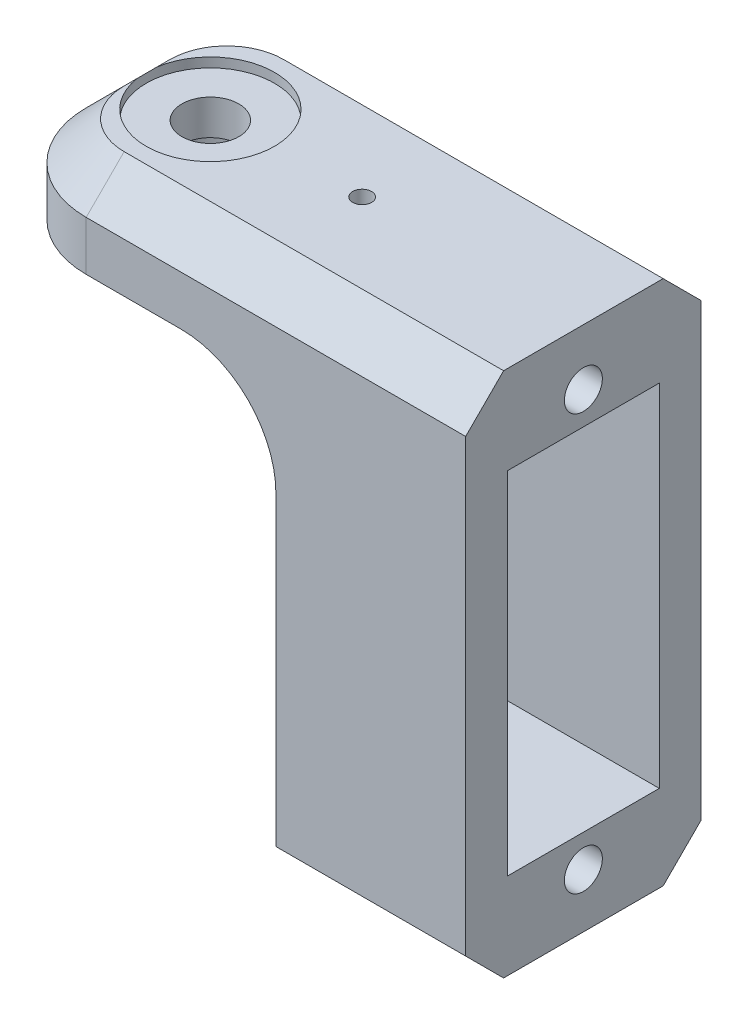
ISO-10303-21;
HEADER;
FILE_DESCRIPTION(('STEP AP214'),'2;1');
FILE_NAME('part.step','',(''),(''),'','','');
FILE_SCHEMA(('AUTOMOTIVE_DESIGN { 1 0 10303 214 1 1 1 1 }'));
ENDSEC;
DATA;
#1=APPLICATION_CONTEXT('core data for automotive mechanical design processes');
#2=APPLICATION_PROTOCOL_DEFINITION('international standard','automotive_design',2000,#1);
#3=PRODUCT_CONTEXT('',#1,'mechanical');
#4=PRODUCT('Part','Part','',(#3));
#5=PRODUCT_RELATED_PRODUCT_CATEGORY('part','',(#4));
#6=PRODUCT_DEFINITION_FORMATION('','',#4);
#7=PRODUCT_DEFINITION_CONTEXT('part definition',#1,'design');
#8=PRODUCT_DEFINITION('design','',#6,#7);
#9=PRODUCT_DEFINITION_SHAPE('','',#8);
#10=(LENGTH_UNIT() NAMED_UNIT(*) SI_UNIT(.MILLI.,.METRE.));
#11=(NAMED_UNIT(*) PLANE_ANGLE_UNIT() SI_UNIT($,.RADIAN.));
#12=(NAMED_UNIT(*) SI_UNIT($,.STERADIAN.) SOLID_ANGLE_UNIT());
#13=UNCERTAINTY_MEASURE_WITH_UNIT(LENGTH_MEASURE(1.E-05),#10,'distance_accuracy_value','');
#14=(GEOMETRIC_REPRESENTATION_CONTEXT(3) GLOBAL_UNCERTAINTY_ASSIGNED_CONTEXT((#13)) GLOBAL_UNIT_ASSIGNED_CONTEXT((#10,
#11,#12)) REPRESENTATION_CONTEXT('',''));
#15=CARTESIAN_POINT('',(0.,0.,0.));
#16=DIRECTION('',(0.,0.,1.));
#17=DIRECTION('',(1.,0.,0.));
#18=AXIS2_PLACEMENT_3D('',#15,#16,#17);
#19=CARTESIAN_POINT('',(0.,0.,0.));
#20=DIRECTION('',(1.,0.,0.));
#21=DIRECTION('',(0.,0.,-1.));
#22=AXIS2_PLACEMENT_3D('',#19,#20,#21);
#23=PLANE('',#22);
#24=DIRECTION('',(0.,-1.,0.));
#25=VECTOR('',#24,1.);
#26=CARTESIAN_POINT('',(0.,20.4056830834917,-3.30344253941829));
#27=LINE('',#26,#25);
#28=CARTESIAN_POINT('',(0.,20.4056830834917,-3.30344253941829));
#29=VERTEX_POINT('',#28);
#30=CARTESIAN_POINT('',(0.,19.0932279719726,-3.30344253941829));
#31=VERTEX_POINT('',#30);
#32=EDGE_CURVE('E232',#29,#31,#27,.T.);
#33=ORIENTED_EDGE('',*,*,#32,.T.);
#34=DIRECTION('',(0.,0.,1.));
#35=VECTOR('',#34,1.);
#36=CARTESIAN_POINT('',(0.,19.0932279719726,-5.23352020477033));
#37=LINE('',#36,#35);
#38=CARTESIAN_POINT('',(0.,19.0932279719726,0.696557460581707));
#39=VERTEX_POINT('',#38);
#40=EDGE_CURVE('E230',#31,#39,#37,.T.);
#41=ORIENTED_EDGE('',*,*,#40,.T.);
#42=DIRECTION('',(0.,-1.,0.));
#43=VECTOR('',#42,1.);
#44=CARTESIAN_POINT('',(0.,20.4056830834917,0.696557460581706));
#45=LINE('',#44,#43);
#46=CARTESIAN_POINT('',(0.,20.4056830834917,0.696557460581706));
#47=VERTEX_POINT('',#46);
#48=EDGE_CURVE('E228',#47,#39,#45,.T.);
#49=ORIENTED_EDGE('',*,*,#48,.F.);
#50=DIRECTION('',(0.,0.,1.));
#51=VECTOR('',#50,1.);
#52=CARTESIAN_POINT('',(0.,20.4056830834917,0.696557460581706));
#53=LINE('',#52,#51);
#54=CARTESIAN_POINT('',(0.,20.4056830834917,-0.313787357402423));
#55=VERTEX_POINT('',#54);
#56=EDGE_CURVE('E213',#55,#47,#53,.T.);
#57=ORIENTED_EDGE('',*,*,#56,.F.);
#58=CARTESIAN_POINT('',(0.,20.7982279719726,-1.23352020477033));
#59=DIRECTION('',(1.,0.,0.));
#60=DIRECTION('',(0.,0.,-1.));
#61=AXIS2_PLACEMENT_3D('',#58,#59,#60);
#62=CIRCLE('',#61,1.);
#63=CARTESIAN_POINT('',(0.,20.4056830834917,-2.15325305213825));
#64=VERTEX_POINT('',#63);
#65=EDGE_CURVE('E275',#55,#64,#62,.T.);
#66=ORIENTED_EDGE('',*,*,#65,.T.);
#67=EDGE_CURVE('E226',#29,#64,#53,.T.);
#68=ORIENTED_EDGE('',*,*,#67,.F.);
#69=EDGE_LOOP('',(#33,#41,#49,#57,#66,#68));
#70=FACE_BOUND('',#69,.T.);
#71=ADVANCED_FACE('F36',(#70),#23,.F.);
#72=CARTESIAN_POINT('',(-9.66004529388442,23.7590291408107,-1.23352020477033));
#73=DIRECTION('',(0.,-1.,0.));
#74=DIRECTION('',(0.,0.,-1.));
#75=AXIS2_PLACEMENT_3D('',#72,#73,#74);
#76=CYLINDRICAL_SURFACE('',#75,1.5);
#77=CARTESIAN_POINT('',(-9.66004529388442,21.4056830834917,-1.23352020477033));
#78=DIRECTION('',(0.,-1.,0.));
#79=DIRECTION('',(0.,0.,-1.));
#80=AXIS2_PLACEMENT_3D('',#77,#78,#79);
#81=CIRCLE('',#80,1.5);
#82=CARTESIAN_POINT('',(-9.66004529388442,21.4056830834917,-2.73352020477033));
#83=VERTEX_POINT('',#82);
#84=EDGE_CURVE('E245',#83,#83,#81,.T.);
#85=ORIENTED_EDGE('',*,*,#84,.T.);
#86=EDGE_LOOP('',(#85));
#87=FACE_BOUND('',#86,.T.);
#88=CARTESIAN_POINT('',(-9.66004529388442,23.2590291408107,-1.23352020477033));
#89=DIRECTION('',(0.,1.,0.));
#90=DIRECTION('',(0.,0.,1.));
#91=AXIS2_PLACEMENT_3D('',#88,#89,#90);
#92=CIRCLE('',#91,1.5);
#93=CARTESIAN_POINT('',(-9.66004529388442,23.2590291408107,0.266479795229666));
#94=VERTEX_POINT('',#93);
#95=EDGE_CURVE('E349',#94,#94,#92,.F.);
#96=ORIENTED_EDGE('',*,*,#95,.F.);
#97=EDGE_LOOP('',(#96));
#98=FACE_BOUND('',#97,.T.);
#99=ADVANCED_FACE('F491',(#87,#98),#76,.F.);
#100=CARTESIAN_POINT('',(0.,0.,0.));
#101=DIRECTION('',(-1.,0.,0.));
#102=DIRECTION('',(0.,0.,1.));
#103=AXIS2_PLACEMENT_3D('',#100,#101,#102);
#104=PLANE('',#103);
#105=EDGE_CURVE('E220',#64,#55,#53,.T.);
#106=ORIENTED_EDGE('',*,*,#105,.F.);
#107=EDGE_CURVE('E268',#64,#55,#62,.T.);
#108=ORIENTED_EDGE('',*,*,#107,.T.);
#109=EDGE_LOOP('',(#106,#108));
#110=FACE_BOUND('',#109,.T.);
#111=ADVANCED_FACE('F486',(#110),#104,.F.);
#112=CARTESIAN_POINT('',(0.,-1.11177202802737,-1.23352020477033));
#113=DIRECTION('',(1.,0.,0.));
#114=DIRECTION('',(0.,0.,-1.));
#115=AXIS2_PLACEMENT_3D('',#112,#113,#114);
#116=CIRCLE('',#115,1.);
#117=CARTESIAN_POINT('',(0.,-1.11177202802737,-2.23352020477033));
#118=VERTEX_POINT('',#117);
#119=EDGE_CURVE('E264',#118,#118,#116,.T.);
#120=ORIENTED_EDGE('',*,*,#119,.T.);
#121=EDGE_LOOP('',(#120));
#122=FACE_BOUND('',#121,.T.);
#123=DIRECTION('',(0.,1.,0.));
#124=VECTOR('',#123,1.);
#125=CARTESIAN_POINT('',(0.,19.0932279719726,-5.23352020477033));
#126=LINE('',#125,#124);
#127=CARTESIAN_POINT('',(0.,0.593227971972626,-5.23352020477033));
#128=VERTEX_POINT('',#127);
#129=CARTESIAN_POINT('',(0.,14.1556830834917,-5.23352020477033));
#130=VERTEX_POINT('',#129);
#131=EDGE_CURVE('E290',#128,#130,#126,.T.);
#132=ORIENTED_EDGE('',*,*,#131,.T.);
#133=DIRECTION('',(0.,0.,1.));
#134=VECTOR('',#133,1.);
#135=CARTESIAN_POINT('',(0.,14.1556830834917,-7.43813416602722));
#136=LINE('',#135,#134);
#137=CARTESIAN_POINT('',(0.,14.1556830834917,-7.43813416602722));
#138=VERTEX_POINT('',#137);
#139=EDGE_CURVE('E420',#130,#138,#136,.F.);
#140=ORIENTED_EDGE('',*,*,#139,.T.);
#141=DIRECTION('',(0.,1.,0.));
#142=VECTOR('',#141,1.);
#143=CARTESIAN_POINT('',(0.,23.7590291408107,-7.43813416602722));
#144=LINE('',#143,#142);
#145=CARTESIAN_POINT('',(0.,-1.95953812104998,-7.43813416602722));
#146=VERTEX_POINT('',#145);
#147=EDGE_CURVE('E302',#146,#138,#144,.T.);
#148=ORIENTED_EDGE('',*,*,#147,.F.);
#149=DIRECTION('',(0.,0.707106781186547,-0.707106781186548));
#150=VECTOR('',#149,1.);
#151=CARTESIAN_POINT('',(0.,-1.95953812104999,-7.43813416602722));
#152=LINE('',#151,#150);
#153=CARTESIAN_POINT('',(0.,-3.95953812104999,-5.43813416602721));
#154=VERTEX_POINT('',#153);
#155=EDGE_CURVE('E393',#146,#154,#152,.F.);
#156=ORIENTED_EDGE('',*,*,#155,.T.);
#157=DIRECTION('',(0.,0.,-1.));
#158=VECTOR('',#157,1.);
#159=CARTESIAN_POINT('',(0.,-3.95953812104999,4.97109375648655));
#160=LINE('',#159,#158);
#161=CARTESIAN_POINT('',(0.,-3.95953812104999,2.97109375648655));
#162=VERTEX_POINT('',#161);
#163=EDGE_CURVE('E307',#162,#154,#160,.T.);
#164=ORIENTED_EDGE('',*,*,#163,.F.);
#165=DIRECTION('',(0.,-0.707106781186548,-0.707106781186547));
#166=VECTOR('',#165,1.);
#167=CARTESIAN_POINT('',(0.,-3.95953812104999,2.97109375648655));
#168=LINE('',#167,#166);
#169=CARTESIAN_POINT('',(0.,-1.95953812104998,4.97109375648655));
#170=VERTEX_POINT('',#169);
#171=EDGE_CURVE('E390',#162,#170,#168,.F.);
#172=ORIENTED_EDGE('',*,*,#171,.T.);
#173=DIRECTION('',(0.,-1.,0.));
#174=VECTOR('',#173,1.);
#175=CARTESIAN_POINT('',(0.,23.7590291408107,4.97109375648655));
#176=LINE('',#175,#174);
#177=CARTESIAN_POINT('',(0.,14.1556830834917,4.97109375648655));
#178=VERTEX_POINT('',#177);
#179=EDGE_CURVE('E319',#178,#170,#176,.T.);
#180=ORIENTED_EDGE('',*,*,#179,.F.);
#181=DIRECTION('',(0.,0.,1.));
#182=VECTOR('',#181,1.);
#183=CARTESIAN_POINT('',(0.,14.1556830834917,0.696557460581707));
#184=LINE('',#183,#182);
#185=CARTESIAN_POINT('',(0.,14.1556830834917,2.76647979522967));
#186=VERTEX_POINT('',#185);
#187=EDGE_CURVE('E418',#178,#186,#184,.F.);
#188=ORIENTED_EDGE('',*,*,#187,.T.);
#189=DIRECTION('',(0.,-1.,0.));
#190=VECTOR('',#189,1.);
#191=CARTESIAN_POINT('',(0.,19.0932279719726,2.76647979522967));
#192=LINE('',#191,#190);
#193=CARTESIAN_POINT('',(0.,0.593227971972625,2.76647979522967));
#194=VERTEX_POINT('',#193);
#195=EDGE_CURVE('E274',#186,#194,#192,.T.);
#196=ORIENTED_EDGE('',*,*,#195,.T.);
#197=DIRECTION('',(0.,0.,-1.));
#198=VECTOR('',#197,1.);
#199=CARTESIAN_POINT('',(0.,0.593227971972626,-5.23352020477033));
#200=LINE('',#199,#198);
#201=EDGE_CURVE('E287',#194,#128,#200,.T.);
#202=ORIENTED_EDGE('',*,*,#201,.T.);
#203=EDGE_LOOP('',(#132,#140,#148,#156,#164,#172,#180,#188,#196,#202));
#204=FACE_BOUND('',#203,.T.);
#205=ADVANCED_FACE('F454',(#122,#204),#23,.F.);
#206=CARTESIAN_POINT('',(10.,0.,0.));
#207=DIRECTION('',(1.,0.,0.));
#208=DIRECTION('',(0.,0.,-1.));
#209=AXIS2_PLACEMENT_3D('',#206,#207,#208);
#210=PLANE('',#209);
#211=CARTESIAN_POINT('',(10.,20.7982279719726,-1.23352020477033));
#212=DIRECTION('',(1.,0.,0.));
#213=DIRECTION('',(0.,0.,-1.));
#214=AXIS2_PLACEMENT_3D('',#211,#212,#213);
#215=CIRCLE('',#214,1.);
#216=CARTESIAN_POINT('',(10.,20.7982279719726,-2.23352020477033));
#217=VERTEX_POINT('',#216);
#218=EDGE_CURVE('E271',#217,#217,#215,.T.);
#219=ORIENTED_EDGE('',*,*,#218,.F.);
#220=EDGE_LOOP('',(#219));
#221=FACE_BOUND('',#220,.T.);
#222=DIRECTION('',(0.,1.,0.));
#223=VECTOR('',#222,1.);
#224=CARTESIAN_POINT('',(10.,23.7590291408107,-7.43813416602722));
#225=LINE('',#224,#223);
#226=CARTESIAN_POINT('',(10.,-1.95953812104998,-7.43813416602722));
#227=VERTEX_POINT('',#226);
#228=CARTESIAN_POINT('',(10.,21.7590291408107,-7.43813416602722));
#229=VERTEX_POINT('',#228);
#230=EDGE_CURVE('E303',#227,#229,#225,.T.);
#231=ORIENTED_EDGE('',*,*,#230,.T.);
#232=DIRECTION('',(0.,-0.707106781186547,-0.707106781186548));
#233=VECTOR('',#232,1.);
#234=CARTESIAN_POINT('',(10.,14.598581653419,-14.598581653419));
#235=LINE('',#234,#233);
#236=CARTESIAN_POINT('',(10.,23.7590291408107,-5.43813416602721));
#237=VERTEX_POINT('',#236);
#238=EDGE_CURVE('E376',#229,#237,#235,.F.);
#239=ORIENTED_EDGE('',*,*,#238,.T.);
#240=DIRECTION('',(0.,0.,1.));
#241=VECTOR('',#240,1.);
#242=CARTESIAN_POINT('',(10.,23.7590291408107,4.97109375648655));
#243=LINE('',#242,#241);
#244=CARTESIAN_POINT('',(10.,23.7590291408107,2.97109375648654));
#245=VERTEX_POINT('',#244);
#246=EDGE_CURVE('E306',#237,#245,#243,.T.);
#247=ORIENTED_EDGE('',*,*,#246,.T.);
#248=DIRECTION('',(0.,0.707106781186547,-0.707106781186548));
#249=VECTOR('',#248,1.);
#250=CARTESIAN_POINT('',(10.,13.3650614486487,13.3650614486486));
#251=LINE('',#250,#249);
#252=CARTESIAN_POINT('',(10.,21.7590291408107,4.97109375648655));
#253=VERTEX_POINT('',#252);
#254=EDGE_CURVE('E374',#245,#253,#251,.F.);
#255=ORIENTED_EDGE('',*,*,#254,.T.);
#256=DIRECTION('',(0.,-1.,0.));
#257=VECTOR('',#256,1.);
#258=CARTESIAN_POINT('',(10.,23.7590291408107,4.97109375648655));
#259=LINE('',#258,#257);
#260=CARTESIAN_POINT('',(10.,-1.95953812104998,4.97109375648655));
#261=VERTEX_POINT('',#260);
#262=EDGE_CURVE('E310',#253,#261,#259,.T.);
#263=ORIENTED_EDGE('',*,*,#262,.T.);
#264=DIRECTION('',(0.,0.707106781186548,0.707106781186547));
#265=VECTOR('',#264,1.);
#266=CARTESIAN_POINT('',(10.,-3.46531593876826,3.46531593876827));
#267=LINE('',#266,#265);
#268=CARTESIAN_POINT('',(10.,-3.95953812104999,2.97109375648655));
#269=VERTEX_POINT('',#268);
#270=EDGE_CURVE('E370',#261,#269,#267,.F.);
#271=ORIENTED_EDGE('',*,*,#270,.T.);
#272=DIRECTION('',(0.,0.,-1.));
#273=VECTOR('',#272,1.);
#274=CARTESIAN_POINT('',(10.,-3.95953812104999,4.97109375648655));
#275=LINE('',#274,#273);
#276=CARTESIAN_POINT('',(10.,-3.95953812104999,-5.43813416602721));
#277=VERTEX_POINT('',#276);
#278=EDGE_CURVE('E313',#269,#277,#275,.T.);
#279=ORIENTED_EDGE('',*,*,#278,.T.);
#280=DIRECTION('',(0.,-0.707106781186547,0.707106781186548));
#281=VECTOR('',#280,1.);
#282=CARTESIAN_POINT('',(10.,-4.6988361435386,-4.6988361435386));
#283=LINE('',#282,#281);
#284=EDGE_CURVE('E372',#277,#227,#283,.F.);
#285=ORIENTED_EDGE('',*,*,#284,.T.);
#286=EDGE_LOOP('',(#231,#239,#247,#255,#263,#271,#279,#285));
#287=FACE_BOUND('',#286,.T.);
#288=DIRECTION('',(0.,0.,-1.));
#289=VECTOR('',#288,1.);
#290=CARTESIAN_POINT('',(10.,0.593227971972626,-5.23352020477033));
#291=LINE('',#290,#289);
#292=CARTESIAN_POINT('',(10.,0.593227971972625,2.76647979522967));
#293=VERTEX_POINT('',#292);
#294=CARTESIAN_POINT('',(10.,0.593227971972626,-5.23352020477033));
#295=VERTEX_POINT('',#294);
#296=EDGE_CURVE('E279',#293,#295,#291,.T.);
#297=ORIENTED_EDGE('',*,*,#296,.F.);
#298=DIRECTION('',(0.,-1.,0.));
#299=VECTOR('',#298,1.);
#300=CARTESIAN_POINT('',(10.,19.0932279719726,2.76647979522967));
#301=LINE('',#300,#299);
#302=CARTESIAN_POINT('',(10.,19.0932279719726,2.76647979522967));
#303=VERTEX_POINT('',#302);
#304=EDGE_CURVE('E277',#303,#293,#301,.T.);
#305=ORIENTED_EDGE('',*,*,#304,.F.);
#306=DIRECTION('',(0.,0.,1.));
#307=VECTOR('',#306,1.);
#308=CARTESIAN_POINT('',(10.,19.0932279719726,-5.23352020477033));
#309=LINE('',#308,#307);
#310=CARTESIAN_POINT('',(10.,19.0932279719726,-5.23352020477033));
#311=VERTEX_POINT('',#310);
#312=EDGE_CURVE('E284',#311,#303,#309,.T.);
#313=ORIENTED_EDGE('',*,*,#312,.F.);
#314=DIRECTION('',(0.,1.,0.));
#315=VECTOR('',#314,1.);
#316=CARTESIAN_POINT('',(10.,19.0932279719726,-5.23352020477033));
#317=LINE('',#316,#315);
#318=EDGE_CURVE('E281',#295,#311,#317,.T.);
#319=ORIENTED_EDGE('',*,*,#318,.F.);
#320=EDGE_LOOP('',(#297,#305,#313,#319));
#321=FACE_BOUND('',#320,.T.);
#322=CARTESIAN_POINT('',(10.,-1.11177202802737,-1.23352020477033));
#323=DIRECTION('',(1.,0.,0.));
#324=DIRECTION('',(0.,0.,-1.));
#325=AXIS2_PLACEMENT_3D('',#322,#323,#324);
#326=CIRCLE('',#325,1.);
#327=CARTESIAN_POINT('',(10.,-1.11177202802737,-2.23352020477033));
#328=VERTEX_POINT('',#327);
#329=EDGE_CURVE('E265',#328,#328,#326,.T.);
#330=ORIENTED_EDGE('',*,*,#329,.F.);
#331=EDGE_LOOP('',(#330));
#332=FACE_BOUND('',#331,.T.);
#333=ADVANCED_FACE('F468',(#221,#287,#321,#332),#210,.T.);
#334=CARTESIAN_POINT('',(10.,23.7590291408107,-7.43813416602722));
#335=DIRECTION('',(0.,0.,1.));
#336=DIRECTION('',(0.,-1.,0.));
#337=AXIS2_PLACEMENT_3D('',#334,#335,#336);
#338=PLANE('',#337);
#339=DIRECTION('',(0.,-1.,0.));
#340=VECTOR('',#339,1.);
#341=CARTESIAN_POINT('',(-10.,23.7590291408107,-7.43813416602722));
#342=LINE('',#341,#340);
#343=CARTESIAN_POINT('',(-10.,19.1556830834917,-7.43813416602722));
#344=VERTEX_POINT('',#343);
#345=CARTESIAN_POINT('',(-10.,21.7590291408107,-7.43813416602722));
#346=VERTEX_POINT('',#345);
#347=EDGE_CURVE('E343',#344,#346,#342,.F.);
#348=ORIENTED_EDGE('',*,*,#347,.T.);
#349=DIRECTION('',(1.,0.,0.));
#350=VECTOR('',#349,1.);
#351=CARTESIAN_POINT('',(10.,21.7590291408107,-7.43813416602722));
#352=LINE('',#351,#350);
#353=EDGE_CURVE('E368',#346,#229,#352,.T.);
#354=ORIENTED_EDGE('',*,*,#353,.T.);
#355=ORIENTED_EDGE('',*,*,#230,.F.);
#356=DIRECTION('',(-1.,0.,0.));
#357=VECTOR('',#356,1.);
#358=CARTESIAN_POINT('',(10.,-1.95953812104999,-7.43813416602722));
#359=LINE('',#358,#357);
#360=EDGE_CURVE('E365',#227,#146,#359,.T.);
#361=ORIENTED_EDGE('',*,*,#360,.T.);
#362=ORIENTED_EDGE('',*,*,#147,.T.);
#363=CARTESIAN_POINT('',(-5.,14.1556830834917,-7.43813416602722));
#364=DIRECTION('',(0.,0.,1.));
#365=DIRECTION('',(0.,-1.,0.));
#366=AXIS2_PLACEMENT_3D('',#363,#364,#365);
#367=CIRCLE('',#366,5.);
#368=CARTESIAN_POINT('',(-5.,19.1556830834917,-7.43813416602722));
#369=VERTEX_POINT('',#368);
#370=EDGE_CURVE('E429',#138,#369,#367,.T.);
#371=ORIENTED_EDGE('',*,*,#370,.T.);
#372=DIRECTION('',(1.,0.,0.));
#373=VECTOR('',#372,1.);
#374=CARTESIAN_POINT('',(-15.,19.1556830834917,-7.43813416602722));
#375=LINE('',#374,#373);
#376=EDGE_CURVE('E261',#344,#369,#375,.T.);
#377=ORIENTED_EDGE('',*,*,#376,.F.);
#378=EDGE_LOOP('',(#348,#354,#355,#361,#362,#371,#377));
#379=FACE_BOUND('',#378,.T.);
#380=ADVANCED_FACE('F472',(#379),#338,.F.);
#381=CARTESIAN_POINT('',(10.,23.7590291408107,4.97109375648655));
#382=DIRECTION('',(0.,-1.,0.));
#383=DIRECTION('',(0.,0.,-1.));
#384=AXIS2_PLACEMENT_3D('',#381,#382,#383);
#385=PLANE('',#384);
#386=ORIENTED_EDGE('',*,*,#246,.F.);
#387=DIRECTION('',(-1.,0.,0.));
#388=VECTOR('',#387,1.);
#389=CARTESIAN_POINT('',(10.,23.7590291408107,-5.43813416602721));
#390=LINE('',#389,#388);
#391=CARTESIAN_POINT('',(-10.,23.7590291408107,-5.43813416602721));
#392=VERTEX_POINT('',#391);
#393=EDGE_CURVE('E362',#237,#392,#390,.T.);
#394=ORIENTED_EDGE('',*,*,#393,.T.);
#395=CARTESIAN_POINT('',(-10.,23.7590291408107,-2.43813416602722));
#396=DIRECTION('',(0.,-1.,0.));
#397=DIRECTION('',(0.,0.,-1.));
#398=AXIS2_PLACEMENT_3D('',#395,#396,#397);
#399=CIRCLE('',#398,2.99999999999999);
#400=CARTESIAN_POINT('',(-13.,23.7590291408107,-2.43813416602722));
#401=VERTEX_POINT('',#400);
#402=EDGE_CURVE('E360',#392,#401,#399,.F.);
#403=ORIENTED_EDGE('',*,*,#402,.T.);
#404=DIRECTION('',(0.,0.,1.));
#405=VECTOR('',#404,1.);
#406=CARTESIAN_POINT('',(-13.,23.7590291408107,-0.0289062435134503));
#407=LINE('',#406,#405);
#408=CARTESIAN_POINT('',(-13.,23.7590291408107,-1.75464651425094));
#409=VERTEX_POINT('',#408);
#410=EDGE_CURVE('E358',#401,#409,#407,.T.);
#411=ORIENTED_EDGE('',*,*,#410,.T.);
#412=CARTESIAN_POINT('',(-9.66004529388442,23.7590291408107,-1.23352020477033));
#413=DIRECTION('',(0.,1.,0.));
#414=DIRECTION('',(0.,0.,1.));
#415=AXIS2_PLACEMENT_3D('',#412,#413,#414);
#416=CIRCLE('',#415,3.38036537512388);
#417=CARTESIAN_POINT('',(-13.,23.7590291408107,-0.712393895289727));
#418=VERTEX_POINT('',#417);
#419=EDGE_CURVE('E412',#418,#409,#416,.T.);
#420=ORIENTED_EDGE('',*,*,#419,.F.);
#421=DIRECTION('',(0.,0.,1.));
#422=VECTOR('',#421,1.);
#423=CARTESIAN_POINT('',(-13.,23.7590291408107,-0.0289062435134503));
#424=LINE('',#423,#422);
#425=CARTESIAN_POINT('',(-13.,23.7590291408107,-0.0289062435134503));
#426=VERTEX_POINT('',#425);
#427=EDGE_CURVE('E356',#418,#426,#424,.T.);
#428=ORIENTED_EDGE('',*,*,#427,.T.);
#429=CARTESIAN_POINT('',(-10.,23.7590291408107,-0.0289062435134503));
#430=DIRECTION('',(0.,-1.,0.));
#431=DIRECTION('',(0.,0.,-1.));
#432=AXIS2_PLACEMENT_3D('',#429,#430,#431);
#433=CIRCLE('',#432,2.99999999999999);
#434=CARTESIAN_POINT('',(-10.,23.7590291408107,2.97109375648654));
#435=VERTEX_POINT('',#434);
#436=EDGE_CURVE('E354',#426,#435,#433,.F.);
#437=ORIENTED_EDGE('',*,*,#436,.T.);
#438=DIRECTION('',(1.,0.,0.));
#439=VECTOR('',#438,1.);
#440=CARTESIAN_POINT('',(10.,23.7590291408107,2.97109375648654));
#441=LINE('',#440,#439);
#442=EDGE_CURVE('E348',#435,#245,#441,.T.);
#443=ORIENTED_EDGE('',*,*,#442,.T.);
#444=EDGE_LOOP('',(#386,#394,#403,#411,#420,#428,#437,#443));
#445=FACE_BOUND('',#444,.T.);
#446=CARTESIAN_POINT('',(-1.66004529388442,23.7590291408107,-1.23352020477033));
#447=DIRECTION('',(0.,-1.,0.));
#448=DIRECTION('',(0.,0.,-1.));
#449=AXIS2_PLACEMENT_3D('',#446,#447,#448);
#450=CIRCLE('',#449,0.5);
#451=CARTESIAN_POINT('',(-1.66004529388442,23.7590291408107,-1.73352020477033));
#452=VERTEX_POINT('',#451);
#453=EDGE_CURVE('E332',#452,#452,#450,.T.);
#454=ORIENTED_EDGE('',*,*,#453,.T.);
#455=EDGE_LOOP('',(#454));
#456=FACE_BOUND('',#455,.T.);
#457=ADVANCED_FACE('F555',(#445,#456),#385,.F.);
#458=CARTESIAN_POINT('',(10.,23.7590291408107,4.97109375648655));
#459=DIRECTION('',(0.,0.,-1.));
#460=DIRECTION('',(-1.,0.,0.));
#461=AXIS2_PLACEMENT_3D('',#458,#459,#460);
#462=PLANE('',#461);
#463=ORIENTED_EDGE('',*,*,#262,.F.);
#464=DIRECTION('',(-1.,0.,0.));
#465=VECTOR('',#464,1.);
#466=CARTESIAN_POINT('',(10.,21.7590291408107,4.97109375648655));
#467=LINE('',#466,#465);
#468=CARTESIAN_POINT('',(-10.,21.7590291408107,4.97109375648655));
#469=VERTEX_POINT('',#468);
#470=EDGE_CURVE('E388',#253,#469,#467,.T.);
#471=ORIENTED_EDGE('',*,*,#470,.T.);
#472=DIRECTION('',(0.,1.,0.));
#473=VECTOR('',#472,1.);
#474=CARTESIAN_POINT('',(-10.,19.1556830834917,4.97109375648655));
#475=LINE('',#474,#473);
#476=CARTESIAN_POINT('',(-10.,19.1556830834917,4.97109375648655));
#477=VERTEX_POINT('',#476);
#478=EDGE_CURVE('E346',#469,#477,#475,.F.);
#479=ORIENTED_EDGE('',*,*,#478,.T.);
#480=DIRECTION('',(1.,0.,0.));
#481=VECTOR('',#480,1.);
#482=CARTESIAN_POINT('',(-15.,19.1556830834917,4.97109375648655));
#483=LINE('',#482,#481);
#484=CARTESIAN_POINT('',(-5.,19.1556830834917,4.97109375648655));
#485=VERTEX_POINT('',#484);
#486=EDGE_CURVE('E258',#477,#485,#483,.T.);
#487=ORIENTED_EDGE('',*,*,#486,.T.);
#488=CARTESIAN_POINT('',(-5.,14.1556830834917,4.97109375648655));
#489=DIRECTION('',(0.,0.,-1.));
#490=DIRECTION('',(-1.,0.,0.));
#491=AXIS2_PLACEMENT_3D('',#488,#489,#490);
#492=CIRCLE('',#491,5.);
#493=EDGE_CURVE('E431',#485,#178,#492,.T.);
#494=ORIENTED_EDGE('',*,*,#493,.T.);
#495=ORIENTED_EDGE('',*,*,#179,.T.);
#496=DIRECTION('',(1.,0.,0.));
#497=VECTOR('',#496,1.);
#498=CARTESIAN_POINT('',(10.,-1.95953812104998,4.97109375648655));
#499=LINE('',#498,#497);
#500=EDGE_CURVE('E386',#170,#261,#499,.T.);
#501=ORIENTED_EDGE('',*,*,#500,.T.);
#502=EDGE_LOOP('',(#463,#471,#479,#487,#494,#495,#501));
#503=FACE_BOUND('',#502,.T.);
#504=ADVANCED_FACE('F550',(#503),#462,.F.);
#505=CARTESIAN_POINT('',(10.,-3.95953812104999,4.97109375648655));
#506=DIRECTION('',(0.,1.,0.));
#507=DIRECTION('',(0.,0.,1.));
#508=AXIS2_PLACEMENT_3D('',#505,#506,#507);
#509=PLANE('',#508);
#510=ORIENTED_EDGE('',*,*,#163,.T.);
#511=DIRECTION('',(1.,0.,0.));
#512=VECTOR('',#511,1.);
#513=CARTESIAN_POINT('',(10.,-3.95953812104999,-5.43813416602721));
#514=LINE('',#513,#512);
#515=EDGE_CURVE('E398',#154,#277,#514,.T.);
#516=ORIENTED_EDGE('',*,*,#515,.T.);
#517=ORIENTED_EDGE('',*,*,#278,.F.);
#518=DIRECTION('',(-1.,0.,0.));
#519=VECTOR('',#518,1.);
#520=CARTESIAN_POINT('',(10.,-3.95953812104999,2.97109375648655));
#521=LINE('',#520,#519);
#522=EDGE_CURVE('E395',#269,#162,#521,.T.);
#523=ORIENTED_EDGE('',*,*,#522,.T.);
#524=EDGE_LOOP('',(#510,#516,#517,#523));
#525=FACE_BOUND('',#524,.T.);
#526=ADVANCED_FACE('F546',(#525),#509,.F.);
#527=CARTESIAN_POINT('',(10.,19.0932279719726,2.76647979522967));
#528=DIRECTION('',(0.,0.,-1.));
#529=DIRECTION('',(0.,1.,0.));
#530=AXIS2_PLACEMENT_3D('',#527,#528,#529);
#531=PLANE('',#530);
#532=ORIENTED_EDGE('',*,*,#195,.F.);
#533=CARTESIAN_POINT('',(-5.,14.1556830834917,2.76647979522967));
#534=DIRECTION('',(0.,0.,-1.));
#535=DIRECTION('',(0.,1.,0.));
#536=AXIS2_PLACEMENT_3D('',#533,#534,#535);
#537=CIRCLE('',#536,5.);
#538=CARTESIAN_POINT('',(-4.2121862693208,19.0932279719726,2.76647979522967));
#539=VERTEX_POINT('',#538);
#540=EDGE_CURVE('E433',#186,#539,#537,.F.);
#541=ORIENTED_EDGE('',*,*,#540,.T.);
#542=DIRECTION('',(-1.,0.,0.));
#543=VECTOR('',#542,1.);
#544=CARTESIAN_POINT('',(10.,19.0932279719726,2.76647979522967));
#545=LINE('',#544,#543);
#546=EDGE_CURVE('E55',#303,#539,#545,.T.);
#547=ORIENTED_EDGE('',*,*,#546,.F.);
#548=ORIENTED_EDGE('',*,*,#304,.T.);
#549=DIRECTION('',(-1.,0.,0.));
#550=VECTOR('',#549,1.);
#551=CARTESIAN_POINT('',(10.,0.593227971972625,2.76647979522967));
#552=LINE('',#551,#550);
#553=EDGE_CURVE('E299',#293,#194,#552,.T.);
#554=ORIENTED_EDGE('',*,*,#553,.T.);
#555=EDGE_LOOP('',(#532,#541,#547,#548,#554));
#556=FACE_BOUND('',#555,.T.);
#557=ADVANCED_FACE('F463',(#556),#531,.T.);
#558=CARTESIAN_POINT('',(10.,0.593227971972626,-5.23352020477033));
#559=DIRECTION('',(0.,1.,0.));
#560=DIRECTION('',(0.,0.,1.));
#561=AXIS2_PLACEMENT_3D('',#558,#559,#560);
#562=PLANE('',#561);
#563=ORIENTED_EDGE('',*,*,#201,.F.);
#564=ORIENTED_EDGE('',*,*,#553,.F.);
#565=ORIENTED_EDGE('',*,*,#296,.T.);
#566=DIRECTION('',(-1.,0.,0.));
#567=VECTOR('',#566,1.);
#568=CARTESIAN_POINT('',(10.,0.593227971972626,-5.23352020477033));
#569=LINE('',#568,#567);
#570=EDGE_CURVE('E297',#295,#128,#569,.T.);
#571=ORIENTED_EDGE('',*,*,#570,.T.);
#572=EDGE_LOOP('',(#563,#564,#565,#571));
#573=FACE_BOUND('',#572,.T.);
#574=ADVANCED_FACE('F460',(#573),#562,.T.);
#575=CARTESIAN_POINT('',(10.,19.0932279719726,-5.23352020477033));
#576=DIRECTION('',(0.,0.,1.));
#577=DIRECTION('',(0.,-1.,0.));
#578=AXIS2_PLACEMENT_3D('',#575,#576,#577);
#579=PLANE('',#578);
#580=ORIENTED_EDGE('',*,*,#131,.F.);
#581=ORIENTED_EDGE('',*,*,#570,.F.);
#582=ORIENTED_EDGE('',*,*,#318,.T.);
#583=DIRECTION('',(-1.,0.,0.));
#584=VECTOR('',#583,1.);
#585=CARTESIAN_POINT('',(10.,19.0932279719726,-5.23352020477033));
#586=LINE('',#585,#584);
#587=CARTESIAN_POINT('',(-4.21218626932775,19.0932279719726,-5.23352020477033));
#588=VERTEX_POINT('',#587);
#589=EDGE_CURVE('E295',#311,#588,#586,.T.);
#590=ORIENTED_EDGE('',*,*,#589,.T.);
#591=CARTESIAN_POINT('',(-5.,14.1556830834917,-5.23352020477033));
#592=DIRECTION('',(0.,0.,1.));
#593=DIRECTION('',(0.,-1.,0.));
#594=AXIS2_PLACEMENT_3D('',#591,#592,#593);
#595=CIRCLE('',#594,5.);
#596=EDGE_CURVE('E427',#588,#130,#595,.F.);
#597=ORIENTED_EDGE('',*,*,#596,.T.);
#598=EDGE_LOOP('',(#580,#581,#582,#590,#597));
#599=FACE_BOUND('',#598,.T.);
#600=ADVANCED_FACE('F451',(#599),#579,.T.);
#601=CARTESIAN_POINT('',(10.,19.0932279719726,-5.23352020477033));
#602=DIRECTION('',(0.,-1.,0.));
#603=DIRECTION('',(0.,0.,-1.));
#604=AXIS2_PLACEMENT_3D('',#601,#602,#603);
#605=PLANE('',#604);
#606=ORIENTED_EDGE('',*,*,#40,.F.);
#607=DIRECTION('',(-1.,0.,0.));
#608=VECTOR('',#607,1.);
#609=CARTESIAN_POINT('',(-11.3232121844668,19.0932279719726,-3.30344253941829));
#610=LINE('',#609,#608);
#611=CARTESIAN_POINT('',(-4.21218626932775,19.0932279719726,-3.30344253941829));
#612=VERTEX_POINT('',#611);
#613=EDGE_CURVE('E44',#31,#612,#610,.T.);
#614=ORIENTED_EDGE('',*,*,#613,.T.);
#615=DIRECTION('',(0.,0.,-1.));
#616=VECTOR('',#615,1.);
#617=CARTESIAN_POINT('',(-4.21218626932775,19.0932279719726,-7.43813416602722));
#618=LINE('',#617,#616);
#619=EDGE_CURVE('E424',#612,#588,#618,.T.);
#620=ORIENTED_EDGE('',*,*,#619,.T.);
#621=ORIENTED_EDGE('',*,*,#589,.F.);
#622=ORIENTED_EDGE('',*,*,#312,.T.);
#623=ORIENTED_EDGE('',*,*,#546,.T.);
#624=DIRECTION('',(0.,0.,-1.));
#625=VECTOR('',#624,1.);
#626=CARTESIAN_POINT('',(-4.21218626932775,19.0932279719726,-7.43813416602722));
#627=LINE('',#626,#625);
#628=CARTESIAN_POINT('',(-4.21218626932775,19.0932279719726,0.696557460581707));
#629=VERTEX_POINT('',#628);
#630=EDGE_CURVE('E51',#539,#629,#627,.T.);
#631=ORIENTED_EDGE('',*,*,#630,.T.);
#632=DIRECTION('',(1.,0.,0.));
#633=VECTOR('',#632,1.);
#634=CARTESIAN_POINT('',(-11.3232121844668,19.0932279719726,0.696557460581706));
#635=LINE('',#634,#633);
#636=EDGE_CURVE('E12',#39,#629,#635,.F.);
#637=ORIENTED_EDGE('',*,*,#636,.F.);
#638=EDGE_LOOP('',(#606,#614,#620,#621,#622,#623,#631,#637));
#639=FACE_BOUND('',#638,.T.);
#640=ADVANCED_FACE('F440',(#639),#605,.T.);
#641=CARTESIAN_POINT('',(10.,20.7982279719726,-1.23352020477033));
#642=DIRECTION('',(-1.,0.,0.));
#643=DIRECTION('',(0.,0.,1.));
#644=AXIS2_PLACEMENT_3D('',#641,#642,#643);
#645=CYLINDRICAL_SURFACE('',#644,1.);
#646=ORIENTED_EDGE('',*,*,#218,.T.);
#647=EDGE_LOOP('',(#646));
#648=FACE_BOUND('',#647,.T.);
#649=ORIENTED_EDGE('',*,*,#65,.F.);
#650=ORIENTED_EDGE('',*,*,#107,.F.);
#651=EDGE_LOOP('',(#649,#650));
#652=FACE_BOUND('',#651,.T.);
#653=ADVANCED_FACE('F481',(#648,#652),#645,.F.);
#654=CARTESIAN_POINT('',(10.,-1.11177202802737,-1.23352020477033));
#655=DIRECTION('',(-1.,0.,0.));
#656=DIRECTION('',(0.,0.,1.));
#657=AXIS2_PLACEMENT_3D('',#654,#655,#656);
#658=CYLINDRICAL_SURFACE('',#657,1.);
#659=ORIENTED_EDGE('',*,*,#329,.T.);
#660=EDGE_LOOP('',(#659));
#661=FACE_BOUND('',#660,.T.);
#662=ORIENTED_EDGE('',*,*,#119,.F.);
#663=EDGE_LOOP('',(#662));
#664=FACE_BOUND('',#663,.T.);
#665=ADVANCED_FACE('F477',(#661,#664),#658,.F.);
#666=CARTESIAN_POINT('',(-15.,0.,0.));
#667=DIRECTION('',(-1.,0.,0.));
#668=DIRECTION('',(0.,0.,1.));
#669=AXIS2_PLACEMENT_3D('',#666,#667,#668);
#670=PLANE('',#669);
#671=DIRECTION('',(0.,1.,0.));
#672=VECTOR('',#671,1.);
#673=CARTESIAN_POINT('',(-15.,23.7590291408107,-0.0289062435134503));
#674=LINE('',#673,#672);
#675=CARTESIAN_POINT('',(-15.,19.1556830834917,-0.0289062435134503));
#676=VERTEX_POINT('',#675);
#677=CARTESIAN_POINT('',(-15.,21.7590291408107,-0.0289062435134503));
#678=VERTEX_POINT('',#677);
#679=EDGE_CURVE('E328',#676,#678,#674,.T.);
#680=ORIENTED_EDGE('',*,*,#679,.T.);
#681=DIRECTION('',(0.,0.,-1.));
#682=VECTOR('',#681,1.);
#683=CARTESIAN_POINT('',(-15.,21.7590291408107,-2.43813416602722));
#684=LINE('',#683,#682);
#685=CARTESIAN_POINT('',(-15.,21.7590291408107,-2.43813416602722));
#686=VERTEX_POINT('',#685);
#687=EDGE_CURVE('E380',#678,#686,#684,.T.);
#688=ORIENTED_EDGE('',*,*,#687,.T.);
#689=DIRECTION('',(0.,-1.,0.));
#690=VECTOR('',#689,1.);
#691=CARTESIAN_POINT('',(-15.,19.1556830834917,-2.43813416602722));
#692=LINE('',#691,#690);
#693=CARTESIAN_POINT('',(-15.,19.1556830834917,-2.43813416602722));
#694=VERTEX_POINT('',#693);
#695=EDGE_CURVE('E337',#686,#694,#692,.T.);
#696=ORIENTED_EDGE('',*,*,#695,.T.);
#697=DIRECTION('',(0.,0.,1.));
#698=VECTOR('',#697,1.);
#699=CARTESIAN_POINT('',(-15.,19.1556830834917,-7.43813416602722));
#700=LINE('',#699,#698);
#701=EDGE_CURVE('E253',#694,#676,#700,.T.);
#702=ORIENTED_EDGE('',*,*,#701,.T.);
#703=EDGE_LOOP('',(#680,#688,#696,#702));
#704=FACE_BOUND('',#703,.T.);
#705=ADVANCED_FACE('F480',(#704),#670,.T.);
#706=CARTESIAN_POINT('',(-15.,19.1556830834917,-7.43813416602722));
#707=DIRECTION('',(0.,1.,0.));
#708=DIRECTION('',(0.,0.,1.));
#709=AXIS2_PLACEMENT_3D('',#706,#707,#708);
#710=PLANE('',#709);
#711=ORIENTED_EDGE('',*,*,#376,.T.);
#712=DIRECTION('',(0.,0.,1.));
#713=VECTOR('',#712,1.);
#714=CARTESIAN_POINT('',(-5.,19.1556830834917,-3.30344253941829));
#715=LINE('',#714,#713);
#716=CARTESIAN_POINT('',(-5.,19.1556830834917,-3.30344253941829));
#717=VERTEX_POINT('',#716);
#718=EDGE_CURVE('E415',#369,#717,#715,.T.);
#719=ORIENTED_EDGE('',*,*,#718,.T.);
#720=DIRECTION('',(1.,0.,0.));
#721=VECTOR('',#720,1.);
#722=CARTESIAN_POINT('',(-11.3232121844668,19.1556830834917,-3.30344253941829));
#723=LINE('',#722,#721);
#724=CARTESIAN_POINT('',(-7.35235780886277,19.1556830834917,-3.30344253941829));
#725=VERTEX_POINT('',#724);
#726=EDGE_CURVE('E224',#725,#717,#723,.T.);
#727=ORIENTED_EDGE('',*,*,#726,.F.);
#728=CARTESIAN_POINT('',(-9.66004529388442,19.1556830834917,-1.23352020477033));
#729=DIRECTION('',(0.,-1.,0.));
#730=DIRECTION('',(0.,0.,-1.));
#731=AXIS2_PLACEMENT_3D('',#728,#729,#730);
#732=CIRCLE('',#731,3.1);
#733=CARTESIAN_POINT('',(-7.23418457947619,19.1556830834917,0.696557460581706));
#734=VERTEX_POINT('',#733);
#735=EDGE_CURVE('E248',#734,#725,#732,.T.);
#736=ORIENTED_EDGE('',*,*,#735,.F.);
#737=DIRECTION('',(-1.,0.,0.));
#738=VECTOR('',#737,1.);
#739=CARTESIAN_POINT('',(-11.3232121844668,19.1556830834917,0.696557460581706));
#740=LINE('',#739,#738);
#741=CARTESIAN_POINT('',(-5.,19.1556830834917,0.696557460581706));
#742=VERTEX_POINT('',#741);
#743=EDGE_CURVE('E243',#742,#734,#740,.T.);
#744=ORIENTED_EDGE('',*,*,#743,.F.);
#745=DIRECTION('',(0.,0.,1.));
#746=VECTOR('',#745,1.);
#747=CARTESIAN_POINT('',(-5.,19.1556830834917,4.97109375648655));
#748=LINE('',#747,#746);
#749=EDGE_CURVE('E400',#742,#485,#748,.T.);
#750=ORIENTED_EDGE('',*,*,#749,.T.);
#751=ORIENTED_EDGE('',*,*,#486,.F.);
#752=CARTESIAN_POINT('',(-10.,19.1556830834917,-0.0289062435134503));
#753=DIRECTION('',(0.,1.,0.));
#754=DIRECTION('',(0.,0.,1.));
#755=AXIS2_PLACEMENT_3D('',#752,#753,#754);
#756=CIRCLE('',#755,5.);
#757=EDGE_CURVE('E339',#477,#676,#756,.F.);
#758=ORIENTED_EDGE('',*,*,#757,.T.);
#759=ORIENTED_EDGE('',*,*,#701,.F.);
#760=CARTESIAN_POINT('',(-10.,19.1556830834917,-2.43813416602722));
#761=DIRECTION('',(0.,1.,0.));
#762=DIRECTION('',(0.,0.,1.));
#763=AXIS2_PLACEMENT_3D('',#760,#761,#762);
#764=CIRCLE('',#763,5.);
#765=EDGE_CURVE('E341',#694,#344,#764,.F.);
#766=ORIENTED_EDGE('',*,*,#765,.T.);
#767=EDGE_LOOP('',(#711,#719,#727,#736,#744,#750,#751,#758,#759,#766));
#768=FACE_BOUND('',#767,.T.);
#769=ADVANCED_FACE('F528',(#768),#710,.F.);
#770=CARTESIAN_POINT('',(-9.66004529388442,21.4056830834917,-1.23352020477033));
#771=DIRECTION('',(0.,-1.,0.));
#772=DIRECTION('',(0.,0.,-1.));
#773=AXIS2_PLACEMENT_3D('',#770,#771,#772);
#774=CYLINDRICAL_SURFACE('',#773,3.1);
#775=ORIENTED_EDGE('',*,*,#735,.T.);
#776=DIRECTION('',(0.,-1.,0.));
#777=VECTOR('',#776,1.);
#778=CARTESIAN_POINT('',(-7.35235780886277,21.4056830834917,-3.30344253941829));
#779=LINE('',#778,#777);
#780=CARTESIAN_POINT('',(-7.35235780886277,20.4056830834917,-3.30344253941829));
#781=VERTEX_POINT('',#780);
#782=EDGE_CURVE('E325',#725,#781,#779,.F.);
#783=ORIENTED_EDGE('',*,*,#782,.T.);
#784=CARTESIAN_POINT('',(-9.66004529388442,20.4056830834917,-1.23352020477033));
#785=DIRECTION('',(0.,-1.,0.));
#786=DIRECTION('',(0.,0.,-1.));
#787=AXIS2_PLACEMENT_3D('',#784,#785,#786);
#788=CIRCLE('',#787,3.1);
#789=CARTESIAN_POINT('',(-7.23418457947619,20.4056830834917,0.696557460581706));
#790=VERTEX_POINT('',#789);
#791=EDGE_CURVE('E316',#790,#781,#788,.F.);
#792=ORIENTED_EDGE('',*,*,#791,.F.);
#793=DIRECTION('',(0.,-1.,0.));
#794=VECTOR('',#793,1.);
#795=CARTESIAN_POINT('',(-7.23418457947619,21.4056830834917,0.696557460581706));
#796=LINE('',#795,#794);
#797=EDGE_CURVE('E237',#790,#734,#796,.T.);
#798=ORIENTED_EDGE('',*,*,#797,.T.);
#799=EDGE_LOOP('',(#775,#783,#792,#798));
#800=FACE_BOUND('',#799,.T.);
#801=CARTESIAN_POINT('',(-9.66004529388442,21.4056830834917,-1.23352020477033));
#802=DIRECTION('',(0.,-1.,0.));
#803=DIRECTION('',(0.,0.,-1.));
#804=AXIS2_PLACEMENT_3D('',#801,#802,#803);
#805=CIRCLE('',#804,3.1);
#806=CARTESIAN_POINT('',(-9.66004529388442,21.4056830834917,-4.33352020477033));
#807=VERTEX_POINT('',#806);
#808=EDGE_CURVE('E250',#807,#807,#805,.T.);
#809=ORIENTED_EDGE('',*,*,#808,.F.);
#810=EDGE_LOOP('',(#809));
#811=FACE_BOUND('',#810,.T.);
#812=ADVANCED_FACE('F524',(#800,#811),#774,.F.);
#813=CARTESIAN_POINT('',(-9.66004529388442,21.4056830834917,-1.23352020477033));
#814=DIRECTION('',(0.,-1.,0.));
#815=DIRECTION('',(0.,0.,-1.));
#816=AXIS2_PLACEMENT_3D('',#813,#814,#815);
#817=PLANE('',#816);
#818=ORIENTED_EDGE('',*,*,#84,.F.);
#819=EDGE_LOOP('',(#818));
#820=FACE_BOUND('',#819,.T.);
#821=ORIENTED_EDGE('',*,*,#808,.T.);
#822=EDGE_LOOP('',(#821));
#823=FACE_BOUND('',#822,.T.);
#824=ADVANCED_FACE('F519',(#820,#823),#817,.T.);
#825=CARTESIAN_POINT('',(-11.3232121844668,20.4056830834917,-3.30344253941829));
#826=DIRECTION('',(0.,0.,-1.));
#827=DIRECTION('',(-1.,0.,0.));
#828=AXIS2_PLACEMENT_3D('',#825,#826,#827);
#829=PLANE('',#828);
#830=ORIENTED_EDGE('',*,*,#726,.T.);
#831=CARTESIAN_POINT('',(-5.,14.1556830834917,-3.30344253941829));
#832=DIRECTION('',(0.,0.,-1.));
#833=DIRECTION('',(-1.,0.,0.));
#834=AXIS2_PLACEMENT_3D('',#831,#832,#833);
#835=CIRCLE('',#834,5.);
#836=EDGE_CURVE('E422',#717,#612,#835,.T.);
#837=ORIENTED_EDGE('',*,*,#836,.T.);
#838=ORIENTED_EDGE('',*,*,#613,.F.);
#839=ORIENTED_EDGE('',*,*,#32,.F.);
#840=DIRECTION('',(1.,0.,0.));
#841=VECTOR('',#840,1.);
#842=CARTESIAN_POINT('',(-11.3232121844668,20.4056830834917,-3.30344253941829));
#843=LINE('',#842,#841);
#844=EDGE_CURVE('E233',#781,#29,#843,.T.);
#845=ORIENTED_EDGE('',*,*,#844,.F.);
#846=ORIENTED_EDGE('',*,*,#782,.F.);
#847=EDGE_LOOP('',(#830,#837,#838,#839,#845,#846));
#848=FACE_BOUND('',#847,.T.);
#849=ADVANCED_FACE('F516',(#848),#829,.F.);
#850=CARTESIAN_POINT('',(-11.3232121844668,20.4056830834917,0.696557460581706));
#851=DIRECTION('',(0.,0.,1.));
#852=DIRECTION('',(1.,0.,0.));
#853=AXIS2_PLACEMENT_3D('',#850,#851,#852);
#854=PLANE('',#853);
#855=DIRECTION('',(-1.,0.,0.));
#856=VECTOR('',#855,1.);
#857=CARTESIAN_POINT('',(-11.3232121844668,20.4056830834917,0.696557460581706));
#858=LINE('',#857,#856);
#859=EDGE_CURVE('E217',#47,#790,#858,.T.);
#860=ORIENTED_EDGE('',*,*,#859,.F.);
#861=ORIENTED_EDGE('',*,*,#48,.T.);
#862=ORIENTED_EDGE('',*,*,#636,.T.);
#863=CARTESIAN_POINT('',(-5.,14.1556830834917,0.696557460581707));
#864=DIRECTION('',(0.,0.,1.));
#865=DIRECTION('',(1.,0.,0.));
#866=AXIS2_PLACEMENT_3D('',#863,#864,#865);
#867=CIRCLE('',#866,5.);
#868=EDGE_CURVE('E436',#629,#742,#867,.T.);
#869=ORIENTED_EDGE('',*,*,#868,.T.);
#870=ORIENTED_EDGE('',*,*,#743,.T.);
#871=ORIENTED_EDGE('',*,*,#797,.F.);
#872=EDGE_LOOP('',(#860,#861,#862,#869,#870,#871));
#873=FACE_BOUND('',#872,.T.);
#874=ADVANCED_FACE('F235',(#873),#854,.F.);
#875=CARTESIAN_POINT('',(0.,20.4056830834917,0.));
#876=DIRECTION('',(0.,-1.,0.));
#877=DIRECTION('',(0.,0.,-1.));
#878=AXIS2_PLACEMENT_3D('',#875,#876,#877);
#879=PLANE('',#878);
#880=CARTESIAN_POINT('',(-1.66004529388442,20.4056830834917,-1.23352020477033));
#881=DIRECTION('',(0.,-1.,0.));
#882=DIRECTION('',(0.,0.,-1.));
#883=AXIS2_PLACEMENT_3D('',#880,#881,#882);
#884=CIRCLE('',#883,0.5);
#885=CARTESIAN_POINT('',(-1.66004529388442,20.4056830834917,-1.73352020477033));
#886=VERTEX_POINT('',#885);
#887=EDGE_CURVE('E329',#886,#886,#884,.T.);
#888=ORIENTED_EDGE('',*,*,#887,.F.);
#889=EDGE_LOOP('',(#888));
#890=FACE_BOUND('',#889,.T.);
#891=ORIENTED_EDGE('',*,*,#791,.T.);
#892=ORIENTED_EDGE('',*,*,#844,.T.);
#893=ORIENTED_EDGE('',*,*,#67,.T.);
#894=ORIENTED_EDGE('',*,*,#105,.T.);
#895=ORIENTED_EDGE('',*,*,#56,.T.);
#896=ORIENTED_EDGE('',*,*,#859,.T.);
#897=EDGE_LOOP('',(#891,#892,#893,#894,#895,#896));
#898=FACE_BOUND('',#897,.T.);
#899=ADVANCED_FACE('F215',(#890,#898),#879,.T.);
#900=CARTESIAN_POINT('',(-1.66004529388442,23.7590291408107,-1.23352020477033));
#901=DIRECTION('',(0.,-1.,0.));
#902=DIRECTION('',(0.,0.,-1.));
#903=AXIS2_PLACEMENT_3D('',#900,#901,#902);
#904=CYLINDRICAL_SURFACE('',#903,0.5);
#905=ORIENTED_EDGE('',*,*,#887,.T.);
#906=EDGE_LOOP('',(#905));
#907=FACE_BOUND('',#906,.T.);
#908=ORIENTED_EDGE('',*,*,#453,.F.);
#909=EDGE_LOOP('',(#908));
#910=FACE_BOUND('',#909,.T.);
#911=ADVANCED_FACE('F508',(#907,#910),#904,.F.);
#912=CARTESIAN_POINT('',(-10.,0.,-2.43813416602722));
#913=DIRECTION('',(0.,1.,0.));
#914=DIRECTION('',(0.,0.,1.));
#915=AXIS2_PLACEMENT_3D('',#912,#913,#914);
#916=CYLINDRICAL_SURFACE('',#915,5.);
#917=ORIENTED_EDGE('',*,*,#695,.F.);
#918=CARTESIAN_POINT('',(-10.,21.7590291408107,-2.43813416602722));
#919=DIRECTION('',(0.,-1.,0.));
#920=DIRECTION('',(0.,0.,-1.));
#921=AXIS2_PLACEMENT_3D('',#918,#919,#920);
#922=CIRCLE('',#921,5.);
#923=EDGE_CURVE('E378',#686,#346,#922,.T.);
#924=ORIENTED_EDGE('',*,*,#923,.T.);
#925=ORIENTED_EDGE('',*,*,#347,.F.);
#926=ORIENTED_EDGE('',*,*,#765,.F.);
#927=EDGE_LOOP('',(#917,#924,#925,#926));
#928=FACE_BOUND('',#927,.T.);
#929=ADVANCED_FACE('F511',(#928),#916,.T.);
#930=CARTESIAN_POINT('',(-10.,0.,-0.0289062435134503));
#931=DIRECTION('',(0.,-1.,0.));
#932=DIRECTION('',(0.,0.,-1.));
#933=AXIS2_PLACEMENT_3D('',#930,#931,#932);
#934=CYLINDRICAL_SURFACE('',#933,5.);
#935=ORIENTED_EDGE('',*,*,#478,.F.);
#936=CARTESIAN_POINT('',(-10.,21.7590291408107,-0.0289062435134503));
#937=DIRECTION('',(0.,-1.,0.));
#938=DIRECTION('',(0.,0.,-1.));
#939=AXIS2_PLACEMENT_3D('',#936,#937,#938);
#940=CIRCLE('',#939,5.);
#941=EDGE_CURVE('E384',#469,#678,#940,.T.);
#942=ORIENTED_EDGE('',*,*,#941,.T.);
#943=ORIENTED_EDGE('',*,*,#679,.F.);
#944=ORIENTED_EDGE('',*,*,#757,.F.);
#945=EDGE_LOOP('',(#935,#942,#943,#944));
#946=FACE_BOUND('',#945,.T.);
#947=ADVANCED_FACE('F567',(#946),#934,.T.);
#948=CARTESIAN_POINT('',(-9.66004529388442,23.2590291408107,-1.23352020477033));
#949=DIRECTION('',(0.,1.,0.));
#950=DIRECTION('',(0.,0.,1.));
#951=AXIS2_PLACEMENT_3D('',#948,#949,#950);
#952=PLANE('',#951);
#953=CARTESIAN_POINT('',(-9.66004529388442,23.2590291408107,-1.23352020477033));
#954=DIRECTION('',(0.,1.,0.));
#955=DIRECTION('',(0.,0.,1.));
#956=AXIS2_PLACEMENT_3D('',#953,#954,#955);
#957=CIRCLE('',#956,3.38036537512388);
#958=CARTESIAN_POINT('',(-9.66004529388442,23.2590291408107,2.14684517035355));
#959=VERTEX_POINT('',#958);
#960=EDGE_CURVE('E352',#959,#959,#957,.T.);
#961=ORIENTED_EDGE('',*,*,#960,.T.);
#962=EDGE_LOOP('',(#961));
#963=FACE_BOUND('',#962,.T.);
#964=ORIENTED_EDGE('',*,*,#95,.T.);
#965=EDGE_LOOP('',(#964));
#966=FACE_BOUND('',#965,.T.);
#967=ADVANCED_FACE('F571',(#963,#966),#952,.T.);
#968=CARTESIAN_POINT('',(-9.66004529388442,23.2590291408107,-1.23352020477033));
#969=DIRECTION('',(0.,1.,0.));
#970=DIRECTION('',(0.,0.,1.));
#971=AXIS2_PLACEMENT_3D('',#968,#969,#970);
#972=CYLINDRICAL_SURFACE('',#971,3.38036537512388);
#973=ORIENTED_EDGE('',*,*,#960,.F.);
#974=EDGE_LOOP('',(#973));
#975=FACE_BOUND('',#974,.T.);
#976=ORIENTED_EDGE('',*,*,#419,.T.);
#977=CARTESIAN_POINT('',(-9.66004529388442,27.0989838469263,-1.23352020477033));
#978=DIRECTION('',(-0.707106781186547,0.707106781186548,0.));
#979=DIRECTION('',(0.707106781186548,0.707106781186547,0.));
#980=AXIS2_PLACEMENT_3D('',#977,#978,#979);
#981=ELLIPSE('',#980,4.7805585592766,3.38036537512388);
#982=EDGE_CURVE('E382',#409,#418,#981,.T.);
#983=ORIENTED_EDGE('',*,*,#982,.T.);
#984=EDGE_LOOP('',(#976,#983));
#985=FACE_BOUND('',#984,.T.);
#986=ADVANCED_FACE('F506',(#975,#985),#972,.F.);
#987=CARTESIAN_POINT('',(10.,21.7590291408107,4.97109375648655));
#988=DIRECTION('',(0.,-0.707106781186548,-0.707106781186547));
#989=DIRECTION('',(-1.,0.,0.));
#990=AXIS2_PLACEMENT_3D('',#987,#988,#989);
#991=PLANE('',#990);
#992=ORIENTED_EDGE('',*,*,#254,.F.);
#993=ORIENTED_EDGE('',*,*,#442,.F.);
#994=DIRECTION('',(0.,0.707106781186547,-0.707106781186548));
#995=VECTOR('',#994,1.);
#996=CARTESIAN_POINT('',(-10.,21.7590291408107,4.97109375648655));
#997=LINE('',#996,#995);
#998=EDGE_CURVE('E409',#469,#435,#997,.T.);
#999=ORIENTED_EDGE('',*,*,#998,.F.);
#1000=ORIENTED_EDGE('',*,*,#470,.F.);
#1001=EDGE_LOOP('',(#992,#993,#999,#1000));
#1002=FACE_BOUND('',#1001,.T.);
#1003=ADVANCED_FACE('F589',(#1002),#991,.F.);
#1004=CARTESIAN_POINT('',(-10.,23.7590291408107,-0.0289062435134503));
#1005=DIRECTION('',(0.,-1.,0.));
#1006=DIRECTION('',(0.,0.,-1.));
#1007=AXIS2_PLACEMENT_3D('',#1004,#1005,#1006);
#1008=CONICAL_SURFACE('',#1007,2.99999999999999,0.785398163397449);
#1009=ORIENTED_EDGE('',*,*,#998,.T.);
#1010=ORIENTED_EDGE('',*,*,#436,.F.);
#1011=DIRECTION('',(0.707106781186548,0.707106781186547,0.));
#1012=VECTOR('',#1011,1.);
#1013=CARTESIAN_POINT('',(-15.,21.7590291408107,-0.0289062435134503));
#1014=LINE('',#1013,#1012);
#1015=EDGE_CURVE('E406',#678,#426,#1014,.T.);
#1016=ORIENTED_EDGE('',*,*,#1015,.F.);
#1017=ORIENTED_EDGE('',*,*,#941,.F.);
#1018=EDGE_LOOP('',(#1009,#1010,#1016,#1017));
#1019=FACE_BOUND('',#1018,.T.);
#1020=ADVANCED_FACE('F585',(#1019),#1008,.T.);
#1021=CARTESIAN_POINT('',(-15.,21.7590291408107,0.));
#1022=DIRECTION('',(-0.707106781186547,0.707106781186548,0.));
#1023=DIRECTION('',(0.,0.,1.));
#1024=AXIS2_PLACEMENT_3D('',#1021,#1022,#1023);
#1025=PLANE('',#1024);
#1026=ORIENTED_EDGE('',*,*,#982,.F.);
#1027=ORIENTED_EDGE('',*,*,#410,.F.);
#1028=DIRECTION('',(0.707106781186548,0.707106781186547,0.));
#1029=VECTOR('',#1028,1.);
#1030=CARTESIAN_POINT('',(-15.,21.7590291408107,-2.43813416602722));
#1031=LINE('',#1030,#1029);
#1032=EDGE_CURVE('E403',#686,#401,#1031,.T.);
#1033=ORIENTED_EDGE('',*,*,#1032,.F.);
#1034=ORIENTED_EDGE('',*,*,#687,.F.);
#1035=ORIENTED_EDGE('',*,*,#1015,.T.);
#1036=ORIENTED_EDGE('',*,*,#427,.F.);
#1037=EDGE_LOOP('',(#1026,#1027,#1033,#1034,#1035,#1036));
#1038=FACE_BOUND('',#1037,.T.);
#1039=ADVANCED_FACE('F581',(#1038),#1025,.T.);
#1040=CARTESIAN_POINT('',(-10.,23.7590291408107,-2.43813416602722));
#1041=DIRECTION('',(0.,-1.,0.));
#1042=DIRECTION('',(0.,0.,-1.));
#1043=AXIS2_PLACEMENT_3D('',#1040,#1041,#1042);
#1044=CONICAL_SURFACE('',#1043,2.99999999999999,0.785398163397449);
#1045=ORIENTED_EDGE('',*,*,#1032,.T.);
#1046=ORIENTED_EDGE('',*,*,#402,.F.);
#1047=DIRECTION('',(0.,0.707106781186547,0.707106781186548));
#1048=VECTOR('',#1047,1.);
#1049=CARTESIAN_POINT('',(-10.,21.7590291408107,-7.43813416602722));
#1050=LINE('',#1049,#1048);
#1051=EDGE_CURVE('E401',#346,#392,#1050,.T.);
#1052=ORIENTED_EDGE('',*,*,#1051,.F.);
#1053=ORIENTED_EDGE('',*,*,#923,.F.);
#1054=EDGE_LOOP('',(#1045,#1046,#1052,#1053));
#1055=FACE_BOUND('',#1054,.T.);
#1056=ADVANCED_FACE('F577',(#1055),#1044,.T.);
#1057=CARTESIAN_POINT('',(10.,23.7590291408107,-5.43813416602721));
#1058=DIRECTION('',(0.,-0.707106781186548,0.707106781186547));
#1059=DIRECTION('',(-1.,0.,0.));
#1060=AXIS2_PLACEMENT_3D('',#1057,#1058,#1059);
#1061=PLANE('',#1060);
#1062=ORIENTED_EDGE('',*,*,#238,.F.);
#1063=ORIENTED_EDGE('',*,*,#353,.F.);
#1064=ORIENTED_EDGE('',*,*,#1051,.T.);
#1065=ORIENTED_EDGE('',*,*,#393,.F.);
#1066=EDGE_LOOP('',(#1062,#1063,#1064,#1065));
#1067=FACE_BOUND('',#1066,.T.);
#1068=ADVANCED_FACE('F573',(#1067),#1061,.F.);
#1069=CARTESIAN_POINT('',(10.,-1.95953812104999,-7.43813416602722));
#1070=DIRECTION('',(0.,0.707106781186548,0.707106781186547));
#1071=DIRECTION('',(-1.,0.,0.));
#1072=AXIS2_PLACEMENT_3D('',#1069,#1070,#1071);
#1073=PLANE('',#1072);
#1074=ORIENTED_EDGE('',*,*,#284,.F.);
#1075=ORIENTED_EDGE('',*,*,#515,.F.);
#1076=ORIENTED_EDGE('',*,*,#155,.F.);
#1077=ORIENTED_EDGE('',*,*,#360,.F.);
#1078=EDGE_LOOP('',(#1074,#1075,#1076,#1077));
#1079=FACE_BOUND('',#1078,.T.);
#1080=ADVANCED_FACE('F576',(#1079),#1073,.F.);
#1081=CARTESIAN_POINT('',(10.,-3.95953812104999,2.97109375648655));
#1082=DIRECTION('',(0.,0.707106781186547,-0.707106781186548));
#1083=DIRECTION('',(-1.,0.,0.));
#1084=AXIS2_PLACEMENT_3D('',#1081,#1082,#1083);
#1085=PLANE('',#1084);
#1086=ORIENTED_EDGE('',*,*,#270,.F.);
#1087=ORIENTED_EDGE('',*,*,#500,.F.);
#1088=ORIENTED_EDGE('',*,*,#171,.F.);
#1089=ORIENTED_EDGE('',*,*,#522,.F.);
#1090=EDGE_LOOP('',(#1086,#1087,#1088,#1089));
#1091=FACE_BOUND('',#1090,.T.);
#1092=ADVANCED_FACE('F596',(#1091),#1085,.F.);
#1093=CARTESIAN_POINT('',(-5.,14.1556830834917,-7.43813416602722));
#1094=DIRECTION('',(0.,0.,-1.));
#1095=DIRECTION('',(-1.,0.,0.));
#1096=AXIS2_PLACEMENT_3D('',#1093,#1094,#1095);
#1097=CYLINDRICAL_SURFACE('',#1096,5.);
#1098=ORIENTED_EDGE('',*,*,#596,.F.);
#1099=ORIENTED_EDGE('',*,*,#619,.F.);
#1100=ORIENTED_EDGE('',*,*,#836,.F.);
#1101=ORIENTED_EDGE('',*,*,#718,.F.);
#1102=ORIENTED_EDGE('',*,*,#370,.F.);
#1103=ORIENTED_EDGE('',*,*,#139,.F.);
#1104=EDGE_LOOP('',(#1098,#1099,#1100,#1101,#1102,#1103));
#1105=FACE_BOUND('',#1104,.T.);
#1106=ADVANCED_FACE('F445',(#1105),#1097,.F.);
#1107=CARTESIAN_POINT('',(-5.,14.1556830834917,-7.43813416602722));
#1108=DIRECTION('',(0.,0.,-1.));
#1109=DIRECTION('',(-1.,0.,0.));
#1110=AXIS2_PLACEMENT_3D('',#1107,#1108,#1109);
#1111=CYLINDRICAL_SURFACE('',#1110,5.);
#1112=ORIENTED_EDGE('',*,*,#540,.F.);
#1113=ORIENTED_EDGE('',*,*,#187,.F.);
#1114=ORIENTED_EDGE('',*,*,#493,.F.);
#1115=ORIENTED_EDGE('',*,*,#749,.F.);
#1116=ORIENTED_EDGE('',*,*,#868,.F.);
#1117=ORIENTED_EDGE('',*,*,#630,.F.);
#1118=EDGE_LOOP('',(#1112,#1113,#1114,#1115,#1116,#1117));
#1119=FACE_BOUND('',#1118,.T.);
#1120=ADVANCED_FACE('F38',(#1119),#1111,.F.);
#1121=CLOSED_SHELL('',(#71,#99,#111,#205,#333,#380,#457,#504,#526,#557,#574,#600,#640,#653,#665,
#705,#769,#812,#824,#849,#874,#899,#911,#929,#947,#967,#986,#1003,#1020,#1039,#1056,#1068,#1080,
#1092,#1106,#1120));
#1122=MANIFOLD_SOLID_BREP('B2',#1121);
#1123=ADVANCED_BREP_SHAPE_REPRESENTATION('',(#18,#1122),#14);
#1124=SHAPE_DEFINITION_REPRESENTATION(#9,#1123);
ENDSEC;
END-ISO-10303-21;
